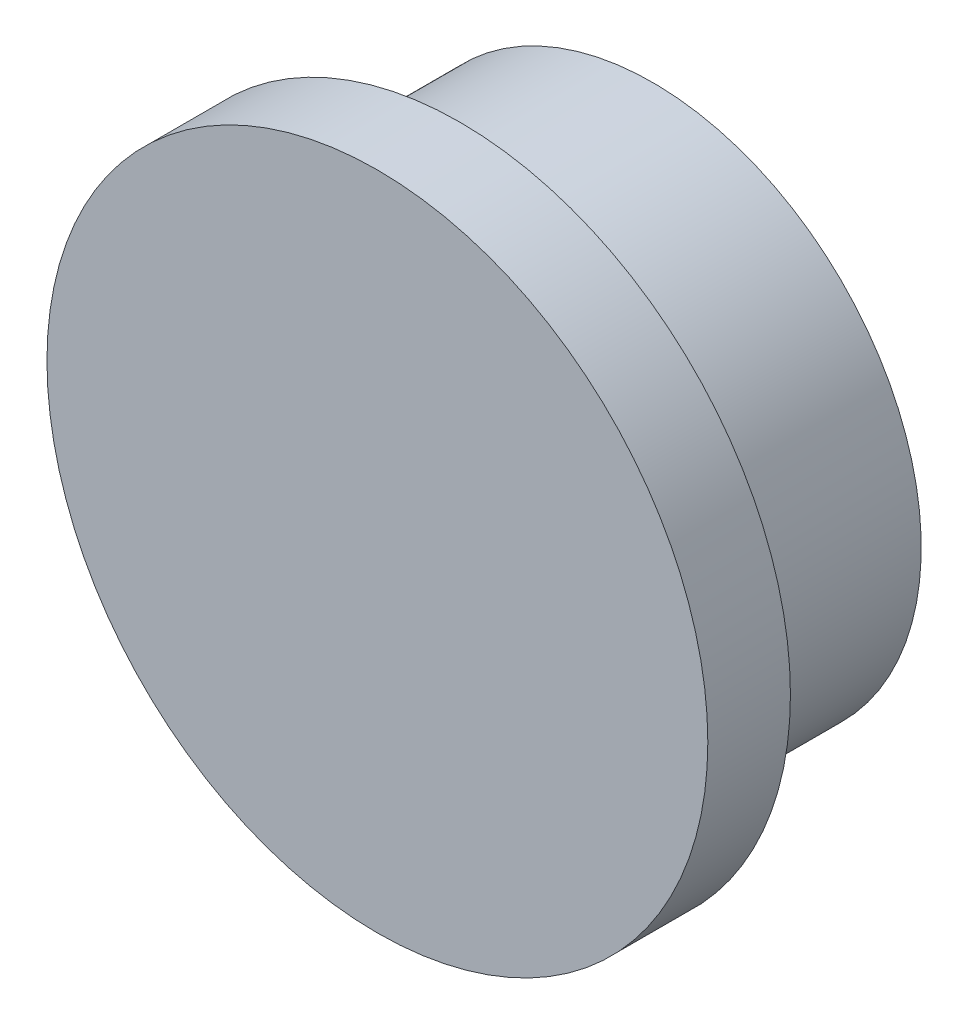
ISO-10303-21;
HEADER;
FILE_DESCRIPTION(('STEP AP214'),'2;1');
FILE_NAME('part.step','',(''),(''),'','','');
FILE_SCHEMA(('AUTOMOTIVE_DESIGN { 1 0 10303 214 1 1 1 1 }'));
ENDSEC;
DATA;
#1=APPLICATION_CONTEXT('core data for automotive mechanical design processes');
#2=APPLICATION_PROTOCOL_DEFINITION('international standard','automotive_design',2000,#1);
#3=PRODUCT_CONTEXT('',#1,'mechanical');
#4=PRODUCT('Part','Part','',(#3));
#5=PRODUCT_RELATED_PRODUCT_CATEGORY('part','',(#4));
#6=PRODUCT_DEFINITION_FORMATION('','',#4);
#7=PRODUCT_DEFINITION_CONTEXT('part definition',#1,'design');
#8=PRODUCT_DEFINITION('design','',#6,#7);
#9=PRODUCT_DEFINITION_SHAPE('','',#8);
#10=(LENGTH_UNIT() NAMED_UNIT(*) SI_UNIT(.MILLI.,.METRE.));
#11=(NAMED_UNIT(*) PLANE_ANGLE_UNIT() SI_UNIT($,.RADIAN.));
#12=(NAMED_UNIT(*) SI_UNIT($,.STERADIAN.) SOLID_ANGLE_UNIT());
#13=UNCERTAINTY_MEASURE_WITH_UNIT(LENGTH_MEASURE(1.E-05),#10,'distance_accuracy_value','');
#14=(GEOMETRIC_REPRESENTATION_CONTEXT(3) GLOBAL_UNCERTAINTY_ASSIGNED_CONTEXT((#13)) GLOBAL_UNIT_ASSIGNED_CONTEXT((#10,
#11,#12)) REPRESENTATION_CONTEXT('',''));
#15=CARTESIAN_POINT('',(0.,0.,0.));
#16=DIRECTION('',(0.,0.,1.));
#17=DIRECTION('',(1.,0.,0.));
#18=AXIS2_PLACEMENT_3D('',#15,#16,#17);
#19=CARTESIAN_POINT('',(-127.992538975237,40.1032592911405,3.));
#20=DIRECTION('',(0.,0.,-1.));
#21=DIRECTION('',(-1.,0.,0.));
#22=AXIS2_PLACEMENT_3D('',#19,#20,#21);
#23=CYLINDRICAL_SURFACE('',#22,12.);
#24=CARTESIAN_POINT('',(-127.992538975237,40.1032592911405,3.));
#25=DIRECTION('',(0.,0.,1.));
#26=DIRECTION('',(1.,0.,0.));
#27=AXIS2_PLACEMENT_3D('',#24,#25,#26);
#28=CIRCLE('',#27,12.);
#29=CARTESIAN_POINT('',(-115.992538975237,40.1032592911405,3.));
#30=VERTEX_POINT('',#29);
#31=EDGE_CURVE('E37',#30,#30,#28,.T.);
#32=ORIENTED_EDGE('',*,*,#31,.F.);
#33=EDGE_LOOP('',(#32));
#34=FACE_BOUND('',#33,.T.);
#35=CARTESIAN_POINT('',(-127.992538975237,40.1032592911405,0.));
#36=DIRECTION('',(0.,0.,1.));
#37=DIRECTION('',(1.,0.,0.));
#38=AXIS2_PLACEMENT_3D('',#35,#36,#37);
#39=CIRCLE('',#38,12.);
#40=CARTESIAN_POINT('',(-115.992538975237,40.1032592911405,0.));
#41=VERTEX_POINT('',#40);
#42=EDGE_CURVE('E33',#41,#41,#39,.T.);
#43=ORIENTED_EDGE('',*,*,#42,.T.);
#44=EDGE_LOOP('',(#43));
#45=FACE_BOUND('',#44,.T.);
#46=ADVANCED_FACE('F30',(#34,#45),#23,.T.);
#47=CARTESIAN_POINT('',(-127.992538975237,40.1032592911405,3.));
#48=DIRECTION('',(0.,0.,1.));
#49=DIRECTION('',(1.,0.,0.));
#50=AXIS2_PLACEMENT_3D('',#47,#48,#49);
#51=PLANE('',#50);
#52=ORIENTED_EDGE('',*,*,#31,.T.);
#53=EDGE_LOOP('',(#52));
#54=FACE_BOUND('',#53,.T.);
#55=ADVANCED_FACE('F74',(#54),#51,.T.);
#56=CARTESIAN_POINT('',(-127.992538975237,40.1032592911405,0.));
#57=DIRECTION('',(0.,0.,1.));
#58=DIRECTION('',(1.,0.,0.));
#59=AXIS2_PLACEMENT_3D('',#56,#57,#58);
#60=PLANE('',#59);
#61=CARTESIAN_POINT('',(-127.992538975237,40.1032592911396,0.));
#62=DIRECTION('',(0.,0.,-1.));
#63=DIRECTION('',(-1.,0.,0.));
#64=AXIS2_PLACEMENT_3D('',#61,#62,#63);
#65=CIRCLE('',#64,9.75000000000002);
#66=CARTESIAN_POINT('',(-137.742538975237,40.1032592911396,0.));
#67=VERTEX_POINT('',#66);
#68=EDGE_CURVE('E10',#67,#67,#65,.T.);
#69=ORIENTED_EDGE('',*,*,#68,.F.);
#70=EDGE_LOOP('',(#69));
#71=FACE_BOUND('',#70,.T.);
#72=ORIENTED_EDGE('',*,*,#42,.F.);
#73=EDGE_LOOP('',(#72));
#74=FACE_BOUND('',#73,.T.);
#75=ADVANCED_FACE('F69',(#71,#74),#60,.F.);
#76=CARTESIAN_POINT('',(-127.992538975237,40.1032592911396,-7.));
#77=DIRECTION('',(0.,0.,1.));
#78=DIRECTION('',(1.,0.,0.));
#79=AXIS2_PLACEMENT_3D('',#76,#77,#78);
#80=CYLINDRICAL_SURFACE('',#79,9.75000000000002);
#81=CARTESIAN_POINT('',(-127.992538975237,40.1032592911396,-7.));
#82=DIRECTION('',(0.,0.,-1.));
#83=DIRECTION('',(-1.,0.,0.));
#84=AXIS2_PLACEMENT_3D('',#81,#82,#83);
#85=CIRCLE('',#84,9.75000000000002);
#86=CARTESIAN_POINT('',(-137.742538975237,40.1032592911396,-7.));
#87=VERTEX_POINT('',#86);
#88=EDGE_CURVE('E43',#87,#87,#85,.T.);
#89=ORIENTED_EDGE('',*,*,#88,.F.);
#90=EDGE_LOOP('',(#89));
#91=FACE_BOUND('',#90,.T.);
#92=ORIENTED_EDGE('',*,*,#68,.T.);
#93=EDGE_LOOP('',(#92));
#94=FACE_BOUND('',#93,.T.);
#95=ADVANCED_FACE('F64',(#91,#94),#80,.T.);
#96=CARTESIAN_POINT('',(-127.992538975237,40.1032592911396,-7.));
#97=DIRECTION('',(0.,0.,-1.));
#98=DIRECTION('',(-1.,0.,0.));
#99=AXIS2_PLACEMENT_3D('',#96,#97,#98);
#100=PLANE('',#99);
#101=CARTESIAN_POINT('',(-127.992538975237,40.1032592911396,-7.));
#102=DIRECTION('',(0.,0.,-1.));
#103=DIRECTION('',(-1.,0.,0.));
#104=AXIS2_PLACEMENT_3D('',#101,#102,#103);
#105=CIRCLE('',#104,2.35);
#106=CARTESIAN_POINT('',(-130.342538975237,40.1032592911396,-7.));
#107=VERTEX_POINT('',#106);
#108=EDGE_CURVE('E47',#107,#107,#105,.T.);
#109=ORIENTED_EDGE('',*,*,#108,.F.);
#110=EDGE_LOOP('',(#109));
#111=FACE_BOUND('',#110,.T.);
#112=ORIENTED_EDGE('',*,*,#88,.T.);
#113=EDGE_LOOP('',(#112));
#114=FACE_BOUND('',#113,.T.);
#115=ADVANCED_FACE('F58',(#111,#114),#100,.T.);
#116=CARTESIAN_POINT('',(-127.992538975237,40.1032592911396,-2.));
#117=DIRECTION('',(0.,0.,-1.));
#118=DIRECTION('',(-1.,0.,0.));
#119=AXIS2_PLACEMENT_3D('',#116,#117,#118);
#120=CYLINDRICAL_SURFACE('',#119,2.35);
#121=CARTESIAN_POINT('',(-127.992538975237,40.1032592911396,-2.));
#122=DIRECTION('',(0.,0.,-1.));
#123=DIRECTION('',(-1.,0.,0.));
#124=AXIS2_PLACEMENT_3D('',#121,#122,#123);
#125=CIRCLE('',#124,2.35);
#126=CARTESIAN_POINT('',(-130.342538975237,40.1032592911396,-2.));
#127=VERTEX_POINT('',#126);
#128=EDGE_CURVE('E46',#127,#127,#125,.T.);
#129=ORIENTED_EDGE('',*,*,#128,.F.);
#130=EDGE_LOOP('',(#129));
#131=FACE_BOUND('',#130,.T.);
#132=ORIENTED_EDGE('',*,*,#108,.T.);
#133=EDGE_LOOP('',(#132));
#134=FACE_BOUND('',#133,.T.);
#135=ADVANCED_FACE('F55',(#131,#134),#120,.F.);
#136=CARTESIAN_POINT('',(-127.992538975237,40.1032592911396,-2.));
#137=DIRECTION('',(0.,0.,-1.));
#138=DIRECTION('',(-1.,0.,0.));
#139=AXIS2_PLACEMENT_3D('',#136,#137,#138);
#140=PLANE('',#139);
#141=ORIENTED_EDGE('',*,*,#128,.T.);
#142=EDGE_LOOP('',(#141));
#143=FACE_BOUND('',#142,.T.);
#144=ADVANCED_FACE('F53',(#143),#140,.T.);
#145=CLOSED_SHELL('',(#46,#55,#75,#95,#115,#135,#144));
#146=MANIFOLD_SOLID_BREP('B2',#145);
#147=ADVANCED_BREP_SHAPE_REPRESENTATION('',(#18,#146),#14);
#148=SHAPE_DEFINITION_REPRESENTATION(#9,#147);
ENDSEC;
END-ISO-10303-21;
